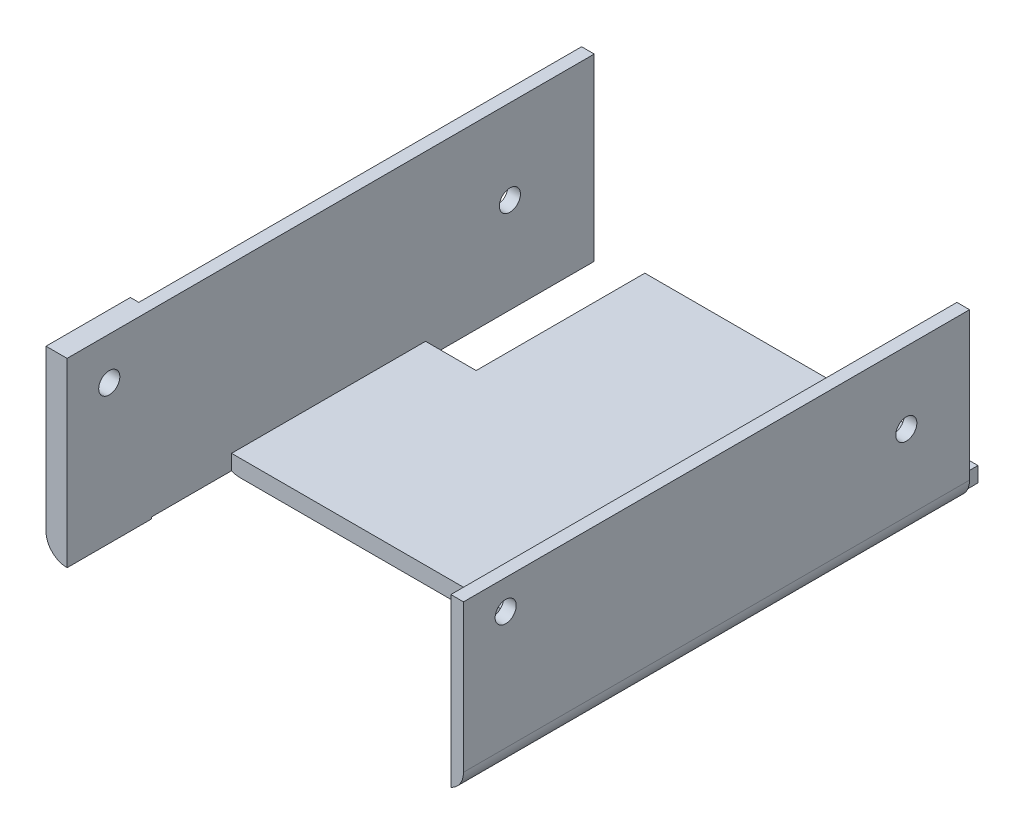
ISO-10303-21;
HEADER;
FILE_DESCRIPTION(('STEP AP214'),'2;1');
FILE_NAME('part.step','',(''),(''),'','','');
FILE_SCHEMA(('AUTOMOTIVE_DESIGN { 1 0 10303 214 1 1 1 1 }'));
ENDSEC;
DATA;
#1=APPLICATION_CONTEXT('core data for automotive mechanical design processes');
#2=APPLICATION_PROTOCOL_DEFINITION('international standard','automotive_design',2000,#1);
#3=PRODUCT_CONTEXT('',#1,'mechanical');
#4=PRODUCT('Part','Part','',(#3));
#5=PRODUCT_RELATED_PRODUCT_CATEGORY('part','',(#4));
#6=PRODUCT_DEFINITION_FORMATION('','',#4);
#7=PRODUCT_DEFINITION_CONTEXT('part definition',#1,'design');
#8=PRODUCT_DEFINITION('design','',#6,#7);
#9=PRODUCT_DEFINITION_SHAPE('','',#8);
#10=(LENGTH_UNIT() NAMED_UNIT(*) SI_UNIT(.MILLI.,.METRE.));
#11=(NAMED_UNIT(*) PLANE_ANGLE_UNIT() SI_UNIT($,.RADIAN.));
#12=(NAMED_UNIT(*) SI_UNIT($,.STERADIAN.) SOLID_ANGLE_UNIT());
#13=UNCERTAINTY_MEASURE_WITH_UNIT(LENGTH_MEASURE(1.E-05),#10,'distance_accuracy_value','');
#14=(GEOMETRIC_REPRESENTATION_CONTEXT(3) GLOBAL_UNCERTAINTY_ASSIGNED_CONTEXT((#13)) GLOBAL_UNIT_ASSIGNED_CONTEXT((#10,
#11,#12)) REPRESENTATION_CONTEXT('',''));
#15=CARTESIAN_POINT('',(0.,0.,0.));
#16=DIRECTION('',(0.,0.,1.));
#17=DIRECTION('',(1.,0.,0.));
#18=AXIS2_PLACEMENT_3D('',#15,#16,#17);
#19=CARTESIAN_POINT('',(56.4756171614078,-26.5771276595745,125.));
#20=DIRECTION('',(0.,1.,0.));
#21=DIRECTION('',(-1.,0.,0.));
#22=AXIS2_PLACEMENT_3D('',#19,#20,#21);
#23=PLANE('',#22);
#24=DIRECTION('',(1.,0.,0.));
#25=VECTOR('',#24,1.);
#26=CARTESIAN_POINT('',(56.4756171614078,-26.5771276595745,0.));
#27=LINE('',#26,#25);
#28=CARTESIAN_POINT('',(-25.5243828385922,-26.5771276595745,0.));
#29=VERTEX_POINT('',#28);
#30=CARTESIAN_POINT('',(51.4756171614078,-26.5771276595745,0.));
#31=VERTEX_POINT('',#30);
#32=EDGE_CURVE('E242',#29,#31,#27,.T.);
#33=ORIENTED_EDGE('',*,*,#32,.T.);
#34=DIRECTION('',(0.,0.,-1.));
#35=VECTOR('',#34,1.);
#36=CARTESIAN_POINT('',(51.4756171614078,-26.5771276595745,125.));
#37=LINE('',#36,#35);
#38=CARTESIAN_POINT('',(51.4756171614078,-26.5771276595745,86.));
#39=VERTEX_POINT('',#38);
#40=EDGE_CURVE('E303',#31,#39,#37,.F.);
#41=ORIENTED_EDGE('',*,*,#40,.T.);
#42=DIRECTION('',(-1.,0.,0.));
#43=VECTOR('',#42,1.);
#44=CARTESIAN_POINT('',(56.4756171614078,-26.5771276595745,86.));
#45=LINE('',#44,#43);
#46=CARTESIAN_POINT('',(-35.5243828385922,-26.5771276595745,86.));
#47=VERTEX_POINT('',#46);
#48=EDGE_CURVE('E284',#39,#47,#45,.T.);
#49=ORIENTED_EDGE('',*,*,#48,.T.);
#50=DIRECTION('',(0.,0.,-1.));
#51=VECTOR('',#50,1.);
#52=CARTESIAN_POINT('',(-35.5243828385922,-26.5771276595745,125.));
#53=LINE('',#52,#51);
#54=CARTESIAN_POINT('',(-35.5243828385922,-26.5771276595745,40.));
#55=VERTEX_POINT('',#54);
#56=EDGE_CURVE('E301',#47,#55,#53,.T.);
#57=ORIENTED_EDGE('',*,*,#56,.T.);
#58=DIRECTION('',(1.,0.,0.));
#59=VECTOR('',#58,1.);
#60=CARTESIAN_POINT('',(56.4756171614078,-26.5771276595745,40.));
#61=LINE('',#60,#59);
#62=CARTESIAN_POINT('',(-25.5243828385922,-26.5771276595745,40.));
#63=VERTEX_POINT('',#62);
#64=EDGE_CURVE('E282',#55,#63,#61,.T.);
#65=ORIENTED_EDGE('',*,*,#64,.T.);
#66=DIRECTION('',(0.,0.,-1.));
#67=VECTOR('',#66,1.);
#68=CARTESIAN_POINT('',(-25.5243828385922,-26.5771276595745,125.));
#69=LINE('',#68,#67);
#70=EDGE_CURVE('E222',#63,#29,#69,.T.);
#71=ORIENTED_EDGE('',*,*,#70,.T.);
#72=EDGE_LOOP('',(#33,#41,#49,#57,#65,#71));
#73=FACE_BOUND('',#72,.T.);
#74=ADVANCED_FACE('F39',(#73),#23,.F.);
#75=CARTESIAN_POINT('',(-40.5243828385922,-26.5771276595745,125.));
#76=DIRECTION('',(1.,0.,0.));
#77=DIRECTION('',(0.,0.,-1.));
#78=AXIS2_PLACEMENT_3D('',#75,#76,#77);
#79=PLANE('',#78);
#80=CARTESIAN_POINT('',(-40.5243828385922,-3.57712765957447,20.));
#81=DIRECTION('',(-1.,0.,0.));
#82=DIRECTION('',(0.,0.,1.));
#83=AXIS2_PLACEMENT_3D('',#80,#81,#82);
#84=CIRCLE('',#83,2.5);
#85=CARTESIAN_POINT('',(-40.5243828385922,-3.57712765957447,22.5));
#86=VERTEX_POINT('',#85);
#87=EDGE_CURVE('E292',#86,#86,#84,.T.);
#88=ORIENTED_EDGE('',*,*,#87,.F.);
#89=EDGE_LOOP('',(#88));
#90=FACE_BOUND('',#89,.T.);
#91=DIRECTION('',(0.,-1.,0.));
#92=VECTOR('',#91,1.);
#93=CARTESIAN_POINT('',(-40.5243828385922,-26.5771276595745,0.));
#94=LINE('',#93,#92);
#95=CARTESIAN_POINT('',(-40.5243828385922,16.4228723404255,0.));
#96=VERTEX_POINT('',#95);
#97=CARTESIAN_POINT('',(-40.5243828385922,-21.5771276595745,0.));
#98=VERTEX_POINT('',#97);
#99=EDGE_CURVE('E254',#96,#98,#94,.T.);
#100=ORIENTED_EDGE('',*,*,#99,.T.);
#101=DIRECTION('',(0.,0.,-1.));
#102=VECTOR('',#101,1.);
#103=CARTESIAN_POINT('',(-40.5243828385922,-21.5771276595745,125.));
#104=LINE('',#103,#102);
#105=CARTESIAN_POINT('',(-40.5243828385922,-21.5771276595745,105.));
#106=VERTEX_POINT('',#105);
#107=EDGE_CURVE('E325',#98,#106,#104,.F.);
#108=ORIENTED_EDGE('',*,*,#107,.T.);
#109=DIRECTION('',(0.,-1.,0.));
#110=VECTOR('',#109,1.);
#111=CARTESIAN_POINT('',(-40.5243828385922,16.4228723404255,105.));
#112=LINE('',#111,#110);
#113=CARTESIAN_POINT('',(-40.5243828385922,16.4228723404255,105.));
#114=VERTEX_POINT('',#113);
#115=EDGE_CURVE('E179',#114,#106,#112,.T.);
#116=ORIENTED_EDGE('',*,*,#115,.F.);
#117=DIRECTION('',(0.,0.,-1.));
#118=VECTOR('',#117,1.);
#119=CARTESIAN_POINT('',(-40.5243828385922,16.4228723404255,125.));
#120=LINE('',#119,#118);
#121=EDGE_CURVE('E261',#114,#96,#120,.T.);
#122=ORIENTED_EDGE('',*,*,#121,.T.);
#123=EDGE_LOOP('',(#100,#108,#116,#122));
#124=FACE_BOUND('',#123,.T.);
#125=ADVANCED_FACE('F341',(#90,#124),#79,.F.);
#126=CARTESIAN_POINT('',(0.,0.,125.));
#127=DIRECTION('',(0.,0.,1.));
#128=DIRECTION('',(1.,0.,0.));
#129=AXIS2_PLACEMENT_3D('',#126,#127,#128);
#130=PLANE('',#129);
#131=DIRECTION('',(0.,1.,0.));
#132=VECTOR('',#131,1.);
#133=CARTESIAN_POINT('',(-42.5243828385922,16.4228723404255,125.));
#134=LINE('',#133,#132);
#135=CARTESIAN_POINT('',(-42.5243828385922,-21.5771276595745,125.));
#136=VERTEX_POINT('',#135);
#137=CARTESIAN_POINT('',(-42.5243828385922,16.4228723404255,125.));
#138=VERTEX_POINT('',#137);
#139=EDGE_CURVE('E171',#136,#138,#134,.T.);
#140=ORIENTED_EDGE('',*,*,#139,.F.);
#141=CARTESIAN_POINT('',(-37.5243828385922,-21.5771276595745,125.));
#142=DIRECTION('',(0.,0.,1.));
#143=DIRECTION('',(1.,0.,0.));
#144=AXIS2_PLACEMENT_3D('',#141,#142,#143);
#145=CIRCLE('',#144,5.);
#146=CARTESIAN_POINT('',(-37.5243828385922,-26.5771276595745,125.));
#147=VERTEX_POINT('',#146);
#148=EDGE_CURVE('E47',#136,#147,#145,.T.);
#149=ORIENTED_EDGE('',*,*,#148,.T.);
#150=DIRECTION('',(0.,1.,0.));
#151=VECTOR('',#150,1.);
#152=CARTESIAN_POINT('',(-37.5243828385922,16.4228723404255,125.));
#153=LINE('',#152,#151);
#154=CARTESIAN_POINT('',(-37.5243828385922,16.4228723404255,125.));
#155=VERTEX_POINT('',#154);
#156=EDGE_CURVE('E185',#147,#155,#153,.T.);
#157=ORIENTED_EDGE('',*,*,#156,.T.);
#158=DIRECTION('',(-1.,0.,0.));
#159=VECTOR('',#158,1.);
#160=CARTESIAN_POINT('',(-40.5243828385922,16.4228723404255,125.));
#161=LINE('',#160,#159);
#162=EDGE_CURVE('E182',#155,#138,#161,.T.);
#163=ORIENTED_EDGE('',*,*,#162,.T.);
#164=EDGE_LOOP('',(#140,#149,#157,#163));
#165=FACE_BOUND('',#164,.T.);
#166=ADVANCED_FACE('F183',(#165),#130,.T.);
#167=CARTESIAN_POINT('',(0.,0.,0.));
#168=DIRECTION('',(0.,0.,1.));
#169=DIRECTION('',(1.,0.,0.));
#170=AXIS2_PLACEMENT_3D('',#167,#168,#169);
#171=PLANE('',#170);
#172=DIRECTION('',(0.,1.,0.));
#173=VECTOR('',#172,1.);
#174=CARTESIAN_POINT('',(-37.5243828385922,16.4228723404255,0.));
#175=LINE('',#174,#173);
#176=CARTESIAN_POINT('',(-37.5243828385922,-26.1597033545303,0.));
#177=VERTEX_POINT('',#176);
#178=CARTESIAN_POINT('',(-37.5243828385922,16.4228723404255,0.));
#179=VERTEX_POINT('',#178);
#180=EDGE_CURVE('E250',#177,#179,#175,.T.);
#181=ORIENTED_EDGE('',*,*,#180,.F.);
#182=CARTESIAN_POINT('',(-35.5243828385922,-21.5771276595745,0.));
#183=DIRECTION('',(0.,0.,1.));
#184=DIRECTION('',(1.,0.,0.));
#185=AXIS2_PLACEMENT_3D('',#182,#183,#184);
#186=CIRCLE('',#185,5.);
#187=EDGE_CURVE('E323',#177,#98,#186,.F.);
#188=ORIENTED_EDGE('',*,*,#187,.T.);
#189=ORIENTED_EDGE('',*,*,#99,.F.);
#190=DIRECTION('',(-1.,0.,0.));
#191=VECTOR('',#190,1.);
#192=CARTESIAN_POINT('',(-40.5243828385922,16.4228723404255,0.));
#193=LINE('',#192,#191);
#194=EDGE_CURVE('E252',#179,#96,#193,.T.);
#195=ORIENTED_EDGE('',*,*,#194,.F.);
#196=EDGE_LOOP('',(#181,#188,#189,#195));
#197=FACE_BOUND('',#196,.T.);
#198=ADVANCED_FACE('F369',(#197),#171,.F.);
#199=CARTESIAN_POINT('',(56.4756171614078,13.4228723404255,125.));
#200=DIRECTION('',(0.,-1.,0.));
#201=DIRECTION('',(0.,0.,-1.));
#202=AXIS2_PLACEMENT_3D('',#199,#200,#201);
#203=PLANE('',#202);
#204=DIRECTION('',(0.,0.,-1.));
#205=VECTOR('',#204,1.);
#206=CARTESIAN_POINT('',(56.4756171614078,13.4228723404255,125.));
#207=LINE('',#206,#205);
#208=CARTESIAN_POINT('',(56.4756171614078,13.4228723404255,125.));
#209=VERTEX_POINT('',#208);
#210=CARTESIAN_POINT('',(56.4756171614078,13.4228723404255,5.));
#211=VERTEX_POINT('',#210);
#212=EDGE_CURVE('E247',#209,#211,#207,.T.);
#213=ORIENTED_EDGE('',*,*,#212,.T.);
#214=DIRECTION('',(-1.,0.,0.));
#215=VECTOR('',#214,1.);
#216=CARTESIAN_POINT('',(56.4756171614078,13.4228723404255,5.));
#217=LINE('',#216,#215);
#218=CARTESIAN_POINT('',(53.4756171614078,13.4228723404256,5.));
#219=VERTEX_POINT('',#218);
#220=EDGE_CURVE('E231',#211,#219,#217,.T.);
#221=ORIENTED_EDGE('',*,*,#220,.T.);
#222=DIRECTION('',(0.,0.,-1.));
#223=VECTOR('',#222,1.);
#224=CARTESIAN_POINT('',(53.4756171614078,13.4228723404255,125.));
#225=LINE('',#224,#223);
#226=CARTESIAN_POINT('',(53.4756171614078,13.4228723404255,125.));
#227=VERTEX_POINT('',#226);
#228=EDGE_CURVE('E271',#227,#219,#225,.T.);
#229=ORIENTED_EDGE('',*,*,#228,.F.);
#230=DIRECTION('',(-1.,0.,0.));
#231=VECTOR('',#230,1.);
#232=CARTESIAN_POINT('',(56.4756171614078,13.4228723404255,125.));
#233=LINE('',#232,#231);
#234=EDGE_CURVE('E238',#209,#227,#233,.T.);
#235=ORIENTED_EDGE('',*,*,#234,.F.);
#236=EDGE_LOOP('',(#213,#221,#229,#235));
#237=FACE_BOUND('',#236,.T.);
#238=ADVANCED_FACE('F365',(#237),#203,.F.);
#239=CARTESIAN_POINT('',(53.4756171614078,13.4228723404255,125.));
#240=DIRECTION('',(1.,0.,0.));
#241=DIRECTION('',(0.,1.,0.));
#242=AXIS2_PLACEMENT_3D('',#239,#240,#241);
#243=PLANE('',#242);
#244=CARTESIAN_POINT('',(53.4756171614078,6.42287234042553,115.));
#245=DIRECTION('',(1.,0.,0.));
#246=DIRECTION('',(0.,1.,0.));
#247=AXIS2_PLACEMENT_3D('',#244,#245,#246);
#248=CIRCLE('',#247,2.50000000000001);
#249=CARTESIAN_POINT('',(53.4756171614078,8.92287234042554,115.));
#250=VERTEX_POINT('',#249);
#251=EDGE_CURVE('E485',#250,#250,#248,.T.);
#252=ORIENTED_EDGE('',*,*,#251,.T.);
#253=EDGE_LOOP('',(#252));
#254=FACE_BOUND('',#253,.T.);
#255=CARTESIAN_POINT('',(53.4756171614078,-3.57712765957447,20.));
#256=DIRECTION('',(1.,0.,0.));
#257=DIRECTION('',(0.,1.,0.));
#258=AXIS2_PLACEMENT_3D('',#255,#256,#257);
#259=CIRCLE('',#258,2.5);
#260=CARTESIAN_POINT('',(53.4756171614078,-1.07712765957447,20.));
#261=VERTEX_POINT('',#260);
#262=EDGE_CURVE('E203',#261,#261,#259,.T.);
#263=ORIENTED_EDGE('',*,*,#262,.T.);
#264=EDGE_LOOP('',(#263));
#265=FACE_BOUND('',#264,.T.);
#266=DIRECTION('',(0.,1.,0.));
#267=VECTOR('',#266,1.);
#268=CARTESIAN_POINT('',(53.4756171614078,-147.577127659574,86.));
#269=LINE('',#268,#267);
#270=CARTESIAN_POINT('',(53.4756171614078,-26.1597033545303,86.));
#271=VERTEX_POINT('',#270);
#272=CARTESIAN_POINT('',(53.4756171614078,-22.5771276595745,86.));
#273=VERTEX_POINT('',#272);
#274=EDGE_CURVE('E208',#271,#273,#269,.T.);
#275=ORIENTED_EDGE('',*,*,#274,.F.);
#276=DIRECTION('',(0.,0.,-1.));
#277=VECTOR('',#276,1.);
#278=CARTESIAN_POINT('',(53.4756171614078,-26.1597033545303,86.));
#279=LINE('',#278,#277);
#280=CARTESIAN_POINT('',(53.4756171614078,-26.1597033545303,125.));
#281=VERTEX_POINT('',#280);
#282=EDGE_CURVE('E309',#271,#281,#279,.F.);
#283=ORIENTED_EDGE('',*,*,#282,.T.);
#284=DIRECTION('',(0.,-1.,0.));
#285=VECTOR('',#284,1.);
#286=CARTESIAN_POINT('',(53.4756171614078,13.4228723404255,125.));
#287=LINE('',#286,#285);
#288=EDGE_CURVE('E241',#227,#281,#287,.T.);
#289=ORIENTED_EDGE('',*,*,#288,.F.);
#290=ORIENTED_EDGE('',*,*,#228,.T.);
#291=DIRECTION('',(0.,1.,0.));
#292=VECTOR('',#291,1.);
#293=CARTESIAN_POINT('',(53.4756171614078,-147.577127659574,5.));
#294=LINE('',#293,#292);
#295=CARTESIAN_POINT('',(53.4756171614078,-22.5771276595745,5.));
#296=VERTEX_POINT('',#295);
#297=EDGE_CURVE('E215',#296,#219,#294,.T.);
#298=ORIENTED_EDGE('',*,*,#297,.F.);
#299=DIRECTION('',(0.,0.,-1.));
#300=VECTOR('',#299,1.);
#301=CARTESIAN_POINT('',(53.4756171614078,-22.5771276595745,125.));
#302=LINE('',#301,#300);
#303=EDGE_CURVE('E268',#273,#296,#302,.T.);
#304=ORIENTED_EDGE('',*,*,#303,.F.);
#305=EDGE_LOOP('',(#275,#283,#289,#290,#298,#304));
#306=FACE_BOUND('',#305,.T.);
#307=ADVANCED_FACE('F361',(#254,#265,#306),#243,.F.);
#308=CARTESIAN_POINT('',(-37.5243828385922,-22.5771276595745,125.));
#309=DIRECTION('',(0.,-1.,0.));
#310=DIRECTION('',(1.,0.,0.));
#311=AXIS2_PLACEMENT_3D('',#308,#309,#310);
#312=PLANE('',#311);
#313=DIRECTION('',(0.,0.,-1.));
#314=VECTOR('',#313,1.);
#315=CARTESIAN_POINT('',(-37.5243828385922,-22.5771276595745,125.));
#316=LINE('',#315,#314);
#317=CARTESIAN_POINT('',(-37.5243828385922,-22.5771276595745,86.));
#318=VERTEX_POINT('',#317);
#319=CARTESIAN_POINT('',(-37.5243828385922,-22.5771276595745,40.));
#320=VERTEX_POINT('',#319);
#321=EDGE_CURVE('E265',#318,#320,#316,.T.);
#322=ORIENTED_EDGE('',*,*,#321,.F.);
#323=DIRECTION('',(-1.,0.,0.));
#324=VECTOR('',#323,1.);
#325=CARTESIAN_POINT('',(-37.5243828385922,-22.5771276595745,86.));
#326=LINE('',#325,#324);
#327=EDGE_CURVE('E205',#273,#318,#326,.T.);
#328=ORIENTED_EDGE('',*,*,#327,.F.);
#329=ORIENTED_EDGE('',*,*,#303,.T.);
#330=DIRECTION('',(0.,0.,-1.));
#331=VECTOR('',#330,1.);
#332=CARTESIAN_POINT('',(53.4756171614078,-22.5771276595745,125.));
#333=LINE('',#332,#331);
#334=CARTESIAN_POINT('',(53.4756171614078,-22.5771276595745,0.));
#335=VERTEX_POINT('',#334);
#336=EDGE_CURVE('E228',#296,#335,#333,.T.);
#337=ORIENTED_EDGE('',*,*,#336,.T.);
#338=DIRECTION('',(-1.,0.,0.));
#339=VECTOR('',#338,1.);
#340=CARTESIAN_POINT('',(-37.5243828385922,-22.5771276595745,0.));
#341=LINE('',#340,#339);
#342=CARTESIAN_POINT('',(-25.5243828385922,-22.5771276595745,0.));
#343=VERTEX_POINT('',#342);
#344=EDGE_CURVE('E237',#335,#343,#341,.T.);
#345=ORIENTED_EDGE('',*,*,#344,.T.);
#346=DIRECTION('',(0.,0.,1.));
#347=VECTOR('',#346,1.);
#348=CARTESIAN_POINT('',(-25.5243828385922,-22.5771276595745,125.));
#349=LINE('',#348,#347);
#350=CARTESIAN_POINT('',(-25.5243828385922,-22.5771276595745,40.));
#351=VERTEX_POINT('',#350);
#352=EDGE_CURVE('E225',#343,#351,#349,.T.);
#353=ORIENTED_EDGE('',*,*,#352,.T.);
#354=DIRECTION('',(-1.,0.,0.));
#355=VECTOR('',#354,1.);
#356=CARTESIAN_POINT('',(-37.5243828385922,-22.5771276595745,40.));
#357=LINE('',#356,#355);
#358=EDGE_CURVE('E234',#351,#320,#357,.T.);
#359=ORIENTED_EDGE('',*,*,#358,.T.);
#360=EDGE_LOOP('',(#322,#328,#329,#337,#345,#353,#359));
#361=FACE_BOUND('',#360,.T.);
#362=ADVANCED_FACE('F357',(#361),#312,.F.);
#363=CARTESIAN_POINT('',(-37.5243828385922,16.4228723404255,125.));
#364=DIRECTION('',(-1.,0.,0.));
#365=DIRECTION('',(0.,-1.,0.));
#366=AXIS2_PLACEMENT_3D('',#363,#364,#365);
#367=PLANE('',#366);
#368=CARTESIAN_POINT('',(-37.5243828385922,6.42287234042553,115.));
#369=DIRECTION('',(-1.,0.,0.));
#370=DIRECTION('',(0.,-1.,0.));
#371=AXIS2_PLACEMENT_3D('',#368,#369,#370);
#372=CIRCLE('',#371,2.50000000000001);
#373=CARTESIAN_POINT('',(-37.5243828385922,3.92287234042552,115.));
#374=VERTEX_POINT('',#373);
#375=EDGE_CURVE('E488',#374,#374,#372,.T.);
#376=ORIENTED_EDGE('',*,*,#375,.T.);
#377=EDGE_LOOP('',(#376));
#378=FACE_BOUND('',#377,.T.);
#379=CARTESIAN_POINT('',(-37.5243828385922,-3.57712765957447,20.));
#380=DIRECTION('',(-1.,0.,0.));
#381=DIRECTION('',(0.,-1.,0.));
#382=AXIS2_PLACEMENT_3D('',#379,#380,#381);
#383=CIRCLE('',#382,2.5);
#384=CARTESIAN_POINT('',(-37.5243828385922,-6.07712765957448,20.));
#385=VERTEX_POINT('',#384);
#386=EDGE_CURVE('E291',#385,#385,#383,.T.);
#387=ORIENTED_EDGE('',*,*,#386,.T.);
#388=EDGE_LOOP('',(#387));
#389=FACE_BOUND('',#388,.T.);
#390=DIRECTION('',(0.,1.,0.));
#391=VECTOR('',#390,1.);
#392=CARTESIAN_POINT('',(-37.5243828385922,-147.577127659574,40.));
#393=LINE('',#392,#391);
#394=CARTESIAN_POINT('',(-37.5243828385922,-26.1597033545303,40.));
#395=VERTEX_POINT('',#394);
#396=EDGE_CURVE('E214',#395,#320,#393,.T.);
#397=ORIENTED_EDGE('',*,*,#396,.F.);
#398=DIRECTION('',(0.,0.,-1.));
#399=VECTOR('',#398,1.);
#400=CARTESIAN_POINT('',(-37.5243828385922,-26.1597033545303,40.));
#401=LINE('',#400,#399);
#402=EDGE_CURVE('E319',#395,#177,#401,.T.);
#403=ORIENTED_EDGE('',*,*,#402,.T.);
#404=ORIENTED_EDGE('',*,*,#180,.T.);
#405=DIRECTION('',(0.,0.,-1.));
#406=VECTOR('',#405,1.);
#407=CARTESIAN_POINT('',(-37.5243828385922,16.4228723404255,125.));
#408=LINE('',#407,#406);
#409=EDGE_CURVE('E263',#155,#179,#408,.T.);
#410=ORIENTED_EDGE('',*,*,#409,.F.);
#411=ORIENTED_EDGE('',*,*,#156,.F.);
#412=DIRECTION('',(0.,0.,1.));
#413=VECTOR('',#412,1.);
#414=CARTESIAN_POINT('',(-37.5243828385922,-26.5771276595745,125.));
#415=LINE('',#414,#413);
#416=CARTESIAN_POINT('',(-37.5243828385922,-26.5771276595745,105.));
#417=VERTEX_POINT('',#416);
#418=EDGE_CURVE('E211',#417,#147,#415,.T.);
#419=ORIENTED_EDGE('',*,*,#418,.F.);
#420=DIRECTION('',(0.,1.,0.));
#421=VECTOR('',#420,1.);
#422=CARTESIAN_POINT('',(-37.5243828385922,16.4228723404255,105.));
#423=LINE('',#422,#421);
#424=CARTESIAN_POINT('',(-37.5243828385922,-26.1597033545303,105.));
#425=VERTEX_POINT('',#424);
#426=EDGE_CURVE('E313',#417,#425,#423,.T.);
#427=ORIENTED_EDGE('',*,*,#426,.T.);
#428=DIRECTION('',(0.,0.,-1.));
#429=VECTOR('',#428,1.);
#430=CARTESIAN_POINT('',(-37.5243828385922,-26.1597033545303,125.));
#431=LINE('',#430,#429);
#432=CARTESIAN_POINT('',(-37.5243828385922,-26.1597033545303,86.));
#433=VERTEX_POINT('',#432);
#434=EDGE_CURVE('E316',#425,#433,#431,.T.);
#435=ORIENTED_EDGE('',*,*,#434,.T.);
#436=DIRECTION('',(0.,1.,0.));
#437=VECTOR('',#436,1.);
#438=CARTESIAN_POINT('',(-37.5243828385922,-147.577127659574,86.));
#439=LINE('',#438,#437);
#440=EDGE_CURVE('E209',#433,#318,#439,.T.);
#441=ORIENTED_EDGE('',*,*,#440,.T.);
#442=ORIENTED_EDGE('',*,*,#321,.T.);
#443=EDGE_LOOP('',(#397,#403,#404,#410,#411,#419,#427,#435,#441,#442));
#444=FACE_BOUND('',#443,.T.);
#445=ADVANCED_FACE('F332',(#378,#389,#444),#367,.F.);
#446=CARTESIAN_POINT('',(-40.5243828385922,16.4228723404255,125.));
#447=DIRECTION('',(0.,-1.,0.));
#448=DIRECTION('',(0.,0.,-1.));
#449=AXIS2_PLACEMENT_3D('',#446,#447,#448);
#450=PLANE('',#449);
#451=ORIENTED_EDGE('',*,*,#194,.T.);
#452=ORIENTED_EDGE('',*,*,#121,.F.);
#453=DIRECTION('',(1.,0.,0.));
#454=VECTOR('',#453,1.);
#455=CARTESIAN_POINT('',(-42.5243828385922,16.4228723404255,105.));
#456=LINE('',#455,#454);
#457=CARTESIAN_POINT('',(-42.5243828385922,16.4228723404255,105.));
#458=VERTEX_POINT('',#457);
#459=EDGE_CURVE('E195',#458,#114,#456,.T.);
#460=ORIENTED_EDGE('',*,*,#459,.F.);
#461=DIRECTION('',(0.,0.,-1.));
#462=VECTOR('',#461,1.);
#463=CARTESIAN_POINT('',(-42.5243828385922,16.4228723404255,125.));
#464=LINE('',#463,#462);
#465=EDGE_CURVE('E175',#138,#458,#464,.T.);
#466=ORIENTED_EDGE('',*,*,#465,.F.);
#467=ORIENTED_EDGE('',*,*,#162,.F.);
#468=ORIENTED_EDGE('',*,*,#409,.T.);
#469=EDGE_LOOP('',(#451,#452,#460,#466,#467,#468));
#470=FACE_BOUND('',#469,.T.);
#471=ADVANCED_FACE('F192',(#470),#450,.F.);
#472=CARTESIAN_POINT('',(56.4756171614078,13.4228723404255,125.));
#473=DIRECTION('',(-1.,0.,0.));
#474=DIRECTION('',(0.,-1.,0.));
#475=AXIS2_PLACEMENT_3D('',#472,#473,#474);
#476=PLANE('',#475);
#477=CARTESIAN_POINT('',(56.4756171614078,6.42287234042553,115.));
#478=DIRECTION('',(-1.,0.,0.));
#479=DIRECTION('',(0.,-1.,0.));
#480=AXIS2_PLACEMENT_3D('',#477,#478,#479);
#481=CIRCLE('',#480,2.50000000000001);
#482=CARTESIAN_POINT('',(56.4756171614078,3.92287234042552,115.));
#483=VERTEX_POINT('',#482);
#484=EDGE_CURVE('E491',#483,#483,#481,.T.);
#485=ORIENTED_EDGE('',*,*,#484,.T.);
#486=EDGE_LOOP('',(#485));
#487=FACE_BOUND('',#486,.T.);
#488=CARTESIAN_POINT('',(56.4756171614078,-3.57712765957447,20.));
#489=DIRECTION('',(-1.,0.,0.));
#490=DIRECTION('',(0.,-1.,0.));
#491=AXIS2_PLACEMENT_3D('',#488,#489,#490);
#492=CIRCLE('',#491,2.5);
#493=CARTESIAN_POINT('',(56.4756171614078,-6.07712765957448,20.));
#494=VERTEX_POINT('',#493);
#495=EDGE_CURVE('E288',#494,#494,#492,.T.);
#496=ORIENTED_EDGE('',*,*,#495,.T.);
#497=EDGE_LOOP('',(#496));
#498=FACE_BOUND('',#497,.T.);
#499=DIRECTION('',(0.,1.,0.));
#500=VECTOR('',#499,1.);
#501=CARTESIAN_POINT('',(56.4756171614078,13.4228723404255,125.));
#502=LINE('',#501,#500);
#503=CARTESIAN_POINT('',(56.4756171614078,-21.5771276595745,125.));
#504=VERTEX_POINT('',#503);
#505=EDGE_CURVE('E189',#504,#209,#502,.T.);
#506=ORIENTED_EDGE('',*,*,#505,.F.);
#507=DIRECTION('',(0.,0.,-1.));
#508=VECTOR('',#507,1.);
#509=CARTESIAN_POINT('',(56.4756171614078,-21.5771276595745,125.));
#510=LINE('',#509,#508);
#511=CARTESIAN_POINT('',(56.4756171614078,-21.5771276595745,5.));
#512=VERTEX_POINT('',#511);
#513=EDGE_CURVE('E287',#504,#512,#510,.T.);
#514=ORIENTED_EDGE('',*,*,#513,.T.);
#515=DIRECTION('',(0.,1.,0.));
#516=VECTOR('',#515,1.);
#517=CARTESIAN_POINT('',(56.4756171614078,13.4228723404255,5.));
#518=LINE('',#517,#516);
#519=EDGE_CURVE('E280',#512,#211,#518,.T.);
#520=ORIENTED_EDGE('',*,*,#519,.T.);
#521=ORIENTED_EDGE('',*,*,#212,.F.);
#522=EDGE_LOOP('',(#506,#514,#520,#521));
#523=FACE_BOUND('',#522,.T.);
#524=ADVANCED_FACE('F350',(#487,#498,#523),#476,.F.);
#525=ORIENTED_EDGE('',*,*,#288,.T.);
#526=CARTESIAN_POINT('',(51.4756171614078,-21.5771276595745,125.));
#527=DIRECTION('',(0.,0.,1.));
#528=DIRECTION('',(1.,0.,0.));
#529=AXIS2_PLACEMENT_3D('',#526,#527,#528);
#530=CIRCLE('',#529,5.);
#531=EDGE_CURVE('E311',#281,#504,#530,.T.);
#532=ORIENTED_EDGE('',*,*,#531,.T.);
#533=ORIENTED_EDGE('',*,*,#505,.T.);
#534=ORIENTED_EDGE('',*,*,#234,.T.);
#535=EDGE_LOOP('',(#525,#532,#533,#534));
#536=FACE_BOUND('',#535,.T.);
#537=ADVANCED_FACE('F414',(#536),#130,.T.);
#538=DIRECTION('',(0.,-1.,0.));
#539=VECTOR('',#538,1.);
#540=CARTESIAN_POINT('',(53.4756171614078,0.,0.));
#541=LINE('',#540,#539);
#542=CARTESIAN_POINT('',(53.4756171614078,-26.1597033545303,0.));
#543=VERTEX_POINT('',#542);
#544=EDGE_CURVE('E277',#335,#543,#541,.T.);
#545=ORIENTED_EDGE('',*,*,#544,.T.);
#546=CARTESIAN_POINT('',(51.4756171614078,-21.5771276595745,0.));
#547=DIRECTION('',(0.,0.,1.));
#548=DIRECTION('',(1.,0.,0.));
#549=AXIS2_PLACEMENT_3D('',#546,#547,#548);
#550=CIRCLE('',#549,5.);
#551=EDGE_CURVE('E299',#543,#31,#550,.F.);
#552=ORIENTED_EDGE('',*,*,#551,.T.);
#553=ORIENTED_EDGE('',*,*,#32,.F.);
#554=DIRECTION('',(0.,1.,0.));
#555=VECTOR('',#554,1.);
#556=CARTESIAN_POINT('',(-25.5243828385922,0.,0.));
#557=LINE('',#556,#555);
#558=EDGE_CURVE('E274',#29,#343,#557,.T.);
#559=ORIENTED_EDGE('',*,*,#558,.T.);
#560=ORIENTED_EDGE('',*,*,#344,.F.);
#561=EDGE_LOOP('',(#545,#552,#553,#559,#560));
#562=FACE_BOUND('',#561,.T.);
#563=ADVANCED_FACE('F401',(#562),#171,.F.);
#564=CARTESIAN_POINT('',(-37.5243828385922,-147.577127659574,40.));
#565=DIRECTION('',(0.,0.,1.));
#566=DIRECTION('',(1.,0.,0.));
#567=AXIS2_PLACEMENT_3D('',#564,#565,#566);
#568=PLANE('',#567);
#569=ORIENTED_EDGE('',*,*,#64,.F.);
#570=CARTESIAN_POINT('',(-35.5243828385922,-21.5771276595745,40.));
#571=DIRECTION('',(0.,0.,1.));
#572=DIRECTION('',(1.,0.,0.));
#573=AXIS2_PLACEMENT_3D('',#570,#571,#572);
#574=CIRCLE('',#573,5.);
#575=EDGE_CURVE('E321',#55,#395,#574,.F.);
#576=ORIENTED_EDGE('',*,*,#575,.T.);
#577=ORIENTED_EDGE('',*,*,#396,.T.);
#578=ORIENTED_EDGE('',*,*,#358,.F.);
#579=DIRECTION('',(0.,1.,0.));
#580=VECTOR('',#579,1.);
#581=CARTESIAN_POINT('',(-25.5243828385922,-147.577127659574,40.));
#582=LINE('',#581,#580);
#583=EDGE_CURVE('E218',#63,#351,#582,.T.);
#584=ORIENTED_EDGE('',*,*,#583,.F.);
#585=EDGE_LOOP('',(#569,#576,#577,#578,#584));
#586=FACE_BOUND('',#585,.T.);
#587=ADVANCED_FACE('F421',(#586),#568,.F.);
#588=CARTESIAN_POINT('',(-25.5243828385922,-147.577127659574,0.));
#589=DIRECTION('',(1.,0.,0.));
#590=DIRECTION('',(0.,0.,-1.));
#591=AXIS2_PLACEMENT_3D('',#588,#589,#590);
#592=PLANE('',#591);
#593=ORIENTED_EDGE('',*,*,#558,.F.);
#594=ORIENTED_EDGE('',*,*,#70,.F.);
#595=ORIENTED_EDGE('',*,*,#583,.T.);
#596=ORIENTED_EDGE('',*,*,#352,.F.);
#597=EDGE_LOOP('',(#593,#594,#595,#596));
#598=FACE_BOUND('',#597,.T.);
#599=ADVANCED_FACE('F447',(#598),#592,.F.);
#600=CARTESIAN_POINT('',(53.4756171614078,-147.577127659574,5.));
#601=DIRECTION('',(0.,0.,1.));
#602=DIRECTION('',(1.,0.,0.));
#603=AXIS2_PLACEMENT_3D('',#600,#601,#602);
#604=PLANE('',#603);
#605=ORIENTED_EDGE('',*,*,#519,.F.);
#606=CARTESIAN_POINT('',(51.4756171614078,-21.5771276595745,5.));
#607=DIRECTION('',(0.,0.,1.));
#608=DIRECTION('',(1.,0.,0.));
#609=AXIS2_PLACEMENT_3D('',#606,#607,#608);
#610=CIRCLE('',#609,5.);
#611=CARTESIAN_POINT('',(53.4756171614078,-26.1597033545303,5.));
#612=VERTEX_POINT('',#611);
#613=EDGE_CURVE('E295',#512,#612,#610,.F.);
#614=ORIENTED_EDGE('',*,*,#613,.T.);
#615=EDGE_CURVE('E217',#612,#296,#294,.T.);
#616=ORIENTED_EDGE('',*,*,#615,.T.);
#617=ORIENTED_EDGE('',*,*,#297,.T.);
#618=ORIENTED_EDGE('',*,*,#220,.F.);
#619=EDGE_LOOP('',(#605,#614,#616,#617,#618));
#620=FACE_BOUND('',#619,.T.);
#621=ADVANCED_FACE('F410',(#620),#604,.F.);
#622=CARTESIAN_POINT('',(53.4756171614078,-147.577127659574,0.));
#623=DIRECTION('',(-1.,0.,0.));
#624=DIRECTION('',(0.,0.,1.));
#625=AXIS2_PLACEMENT_3D('',#622,#623,#624);
#626=PLANE('',#625);
#627=ORIENTED_EDGE('',*,*,#615,.F.);
#628=DIRECTION('',(0.,0.,-1.));
#629=VECTOR('',#628,1.);
#630=CARTESIAN_POINT('',(53.4756171614078,-26.1597033545303,5.));
#631=LINE('',#630,#629);
#632=EDGE_CURVE('E297',#612,#543,#631,.T.);
#633=ORIENTED_EDGE('',*,*,#632,.T.);
#634=ORIENTED_EDGE('',*,*,#544,.F.);
#635=ORIENTED_EDGE('',*,*,#336,.F.);
#636=EDGE_LOOP('',(#627,#633,#634,#635));
#637=FACE_BOUND('',#636,.T.);
#638=ADVANCED_FACE('F398',(#637),#626,.F.);
#639=CARTESIAN_POINT('',(-37.5243828385922,-147.577127659574,86.));
#640=DIRECTION('',(0.,0.,-1.));
#641=DIRECTION('',(-1.,0.,0.));
#642=AXIS2_PLACEMENT_3D('',#639,#640,#641);
#643=PLANE('',#642);
#644=ORIENTED_EDGE('',*,*,#48,.F.);
#645=CARTESIAN_POINT('',(51.4756171614078,-21.5771276595745,86.));
#646=DIRECTION('',(0.,0.,-1.));
#647=DIRECTION('',(-1.,0.,0.));
#648=AXIS2_PLACEMENT_3D('',#645,#646,#647);
#649=CIRCLE('',#648,5.);
#650=EDGE_CURVE('E307',#39,#271,#649,.F.);
#651=ORIENTED_EDGE('',*,*,#650,.T.);
#652=ORIENTED_EDGE('',*,*,#274,.T.);
#653=ORIENTED_EDGE('',*,*,#327,.T.);
#654=ORIENTED_EDGE('',*,*,#440,.F.);
#655=CARTESIAN_POINT('',(-35.5243828385922,-21.5771276595745,86.));
#656=DIRECTION('',(0.,0.,-1.));
#657=DIRECTION('',(-1.,0.,0.));
#658=AXIS2_PLACEMENT_3D('',#655,#656,#657);
#659=CIRCLE('',#658,5.);
#660=EDGE_CURVE('E305',#433,#47,#659,.F.);
#661=ORIENTED_EDGE('',*,*,#660,.T.);
#662=EDGE_LOOP('',(#644,#651,#652,#653,#654,#661));
#663=FACE_BOUND('',#662,.T.);
#664=ADVANCED_FACE('F388',(#663),#643,.F.);
#665=CARTESIAN_POINT('',(-42.5243828385922,16.4228723404255,105.));
#666=DIRECTION('',(0.,0.,1.));
#667=DIRECTION('',(0.,-1.,0.));
#668=AXIS2_PLACEMENT_3D('',#665,#666,#667);
#669=PLANE('',#668);
#670=ORIENTED_EDGE('',*,*,#426,.F.);
#671=CARTESIAN_POINT('',(-37.5243828385922,-21.5771276595745,105.));
#672=DIRECTION('',(0.,0.,1.));
#673=DIRECTION('',(0.,-1.,0.));
#674=AXIS2_PLACEMENT_3D('',#671,#672,#673);
#675=CIRCLE('',#674,5.);
#676=CARTESIAN_POINT('',(-42.5243828385922,-21.5771276595745,105.));
#677=VERTEX_POINT('',#676);
#678=EDGE_CURVE('E11',#417,#677,#675,.F.);
#679=ORIENTED_EDGE('',*,*,#678,.T.);
#680=DIRECTION('',(0.,-1.,0.));
#681=VECTOR('',#680,1.);
#682=CARTESIAN_POINT('',(-42.5243828385922,16.4228723404255,105.));
#683=LINE('',#682,#681);
#684=EDGE_CURVE('E196',#458,#677,#683,.T.);
#685=ORIENTED_EDGE('',*,*,#684,.F.);
#686=ORIENTED_EDGE('',*,*,#459,.T.);
#687=ORIENTED_EDGE('',*,*,#115,.T.);
#688=CARTESIAN_POINT('',(-35.5243828385922,-21.5771276595745,105.));
#689=DIRECTION('',(0.,0.,1.));
#690=DIRECTION('',(0.,-1.,0.));
#691=AXIS2_PLACEMENT_3D('',#688,#689,#690);
#692=CIRCLE('',#691,5.);
#693=EDGE_CURVE('E327',#106,#425,#692,.T.);
#694=ORIENTED_EDGE('',*,*,#693,.T.);
#695=EDGE_LOOP('',(#670,#679,#685,#686,#687,#694));
#696=FACE_BOUND('',#695,.T.);
#697=ADVANCED_FACE('F441',(#696),#669,.F.);
#698=CARTESIAN_POINT('',(-42.5243828385922,0.,0.));
#699=DIRECTION('',(1.,0.,0.));
#700=DIRECTION('',(0.,0.,-1.));
#701=AXIS2_PLACEMENT_3D('',#698,#699,#700);
#702=PLANE('',#701);
#703=CARTESIAN_POINT('',(-42.5243828385922,6.42287234042553,115.));
#704=DIRECTION('',(-1.,0.,0.));
#705=DIRECTION('',(0.,0.,1.));
#706=AXIS2_PLACEMENT_3D('',#703,#704,#705);
#707=CIRCLE('',#706,2.50000000000001);
#708=CARTESIAN_POINT('',(-42.5243828385922,6.42287234042553,117.5));
#709=VERTEX_POINT('',#708);
#710=EDGE_CURVE('E494',#709,#709,#707,.T.);
#711=ORIENTED_EDGE('',*,*,#710,.F.);
#712=EDGE_LOOP('',(#711));
#713=FACE_BOUND('',#712,.T.);
#714=ORIENTED_EDGE('',*,*,#684,.T.);
#715=DIRECTION('',(0.,0.,1.));
#716=VECTOR('',#715,1.);
#717=CARTESIAN_POINT('',(-42.5243828385922,-21.5771276595745,0.));
#718=LINE('',#717,#716);
#719=EDGE_CURVE('E177',#677,#136,#718,.T.);
#720=ORIENTED_EDGE('',*,*,#719,.T.);
#721=ORIENTED_EDGE('',*,*,#139,.T.);
#722=ORIENTED_EDGE('',*,*,#465,.T.);
#723=EDGE_LOOP('',(#714,#720,#721,#722));
#724=FACE_BOUND('',#723,.T.);
#725=ADVANCED_FACE('F173',(#713,#724),#702,.F.);
#726=CARTESIAN_POINT('',(83.4756171614078,-3.57712765957447,20.));
#727=DIRECTION('',(-1.,0.,0.));
#728=DIRECTION('',(0.,0.,1.));
#729=AXIS2_PLACEMENT_3D('',#726,#727,#728);
#730=CYLINDRICAL_SURFACE('',#729,2.5);
#731=ORIENTED_EDGE('',*,*,#495,.F.);
#732=EDGE_LOOP('',(#731));
#733=FACE_BOUND('',#732,.T.);
#734=ORIENTED_EDGE('',*,*,#262,.F.);
#735=EDGE_LOOP('',(#734));
#736=FACE_BOUND('',#735,.T.);
#737=ADVANCED_FACE('F466',(#733,#736),#730,.F.);
#738=ORIENTED_EDGE('',*,*,#87,.T.);
#739=EDGE_LOOP('',(#738));
#740=FACE_BOUND('',#739,.T.);
#741=ORIENTED_EDGE('',*,*,#386,.F.);
#742=EDGE_LOOP('',(#741));
#743=FACE_BOUND('',#742,.T.);
#744=ADVANCED_FACE('F469',(#740,#743),#730,.F.);
#745=CARTESIAN_POINT('',(81.4756171614078,6.42287234042553,115.));
#746=DIRECTION('',(-1.,0.,0.));
#747=DIRECTION('',(0.,0.,1.));
#748=AXIS2_PLACEMENT_3D('',#745,#746,#747);
#749=CYLINDRICAL_SURFACE('',#748,2.50000000000001);
#750=ORIENTED_EDGE('',*,*,#710,.T.);
#751=EDGE_LOOP('',(#750));
#752=FACE_BOUND('',#751,.T.);
#753=ORIENTED_EDGE('',*,*,#375,.F.);
#754=EDGE_LOOP('',(#753));
#755=FACE_BOUND('',#754,.T.);
#756=ADVANCED_FACE('F377',(#752,#755),#749,.F.);
#757=ORIENTED_EDGE('',*,*,#484,.F.);
#758=EDGE_LOOP('',(#757));
#759=FACE_BOUND('',#758,.T.);
#760=ORIENTED_EDGE('',*,*,#251,.F.);
#761=EDGE_LOOP('',(#760));
#762=FACE_BOUND('',#761,.T.);
#763=ADVANCED_FACE('F372',(#759,#762),#749,.F.);
#764=CARTESIAN_POINT('',(51.4756171614078,-21.5771276595745,125.));
#765=DIRECTION('',(0.,0.,-1.));
#766=DIRECTION('',(-1.,0.,0.));
#767=AXIS2_PLACEMENT_3D('',#764,#765,#766);
#768=CYLINDRICAL_SURFACE('',#767,5.);
#769=ORIENTED_EDGE('',*,*,#650,.F.);
#770=ORIENTED_EDGE('',*,*,#40,.F.);
#771=ORIENTED_EDGE('',*,*,#551,.F.);
#772=ORIENTED_EDGE('',*,*,#632,.F.);
#773=ORIENTED_EDGE('',*,*,#613,.F.);
#774=ORIENTED_EDGE('',*,*,#513,.F.);
#775=ORIENTED_EDGE('',*,*,#531,.F.);
#776=ORIENTED_EDGE('',*,*,#282,.F.);
#777=EDGE_LOOP('',(#769,#770,#771,#772,#773,#774,#775,#776));
#778=FACE_BOUND('',#777,.T.);
#779=ADVANCED_FACE('F338',(#778),#768,.T.);
#780=CARTESIAN_POINT('',(-35.5243828385922,-21.5771276595745,125.));
#781=DIRECTION('',(0.,0.,-1.));
#782=DIRECTION('',(-1.,0.,0.));
#783=AXIS2_PLACEMENT_3D('',#780,#781,#782);
#784=CYLINDRICAL_SURFACE('',#783,5.);
#785=ORIENTED_EDGE('',*,*,#693,.F.);
#786=ORIENTED_EDGE('',*,*,#107,.F.);
#787=ORIENTED_EDGE('',*,*,#187,.F.);
#788=ORIENTED_EDGE('',*,*,#402,.F.);
#789=ORIENTED_EDGE('',*,*,#575,.F.);
#790=ORIENTED_EDGE('',*,*,#56,.F.);
#791=ORIENTED_EDGE('',*,*,#660,.F.);
#792=ORIENTED_EDGE('',*,*,#434,.F.);
#793=EDGE_LOOP('',(#785,#786,#787,#788,#789,#790,#791,#792));
#794=FACE_BOUND('',#793,.T.);
#795=ADVANCED_FACE('F334',(#794),#784,.T.);
#796=CARTESIAN_POINT('',(-37.5243828385922,-21.5771276595745,0.));
#797=DIRECTION('',(0.,0.,1.));
#798=DIRECTION('',(1.,0.,0.));
#799=AXIS2_PLACEMENT_3D('',#796,#797,#798);
#800=CYLINDRICAL_SURFACE('',#799,5.);
#801=ORIENTED_EDGE('',*,*,#678,.F.);
#802=ORIENTED_EDGE('',*,*,#418,.T.);
#803=ORIENTED_EDGE('',*,*,#148,.F.);
#804=ORIENTED_EDGE('',*,*,#719,.F.);
#805=EDGE_LOOP('',(#801,#802,#803,#804));
#806=FACE_BOUND('',#805,.T.);
#807=ADVANCED_FACE('F41',(#806),#800,.T.);
#808=CLOSED_SHELL('',(#74,#125,#166,#198,#238,#307,#362,#445,#471,#524,#537,#563,#587,#599,#621,
#638,#664,#697,#725,#737,#744,#756,#763,#779,#795,#807));
#809=MANIFOLD_SOLID_BREP('B2',#808);
#810=ADVANCED_BREP_SHAPE_REPRESENTATION('',(#18,#809),#14);
#811=SHAPE_DEFINITION_REPRESENTATION(#9,#810);
ENDSEC;
END-ISO-10303-21;
